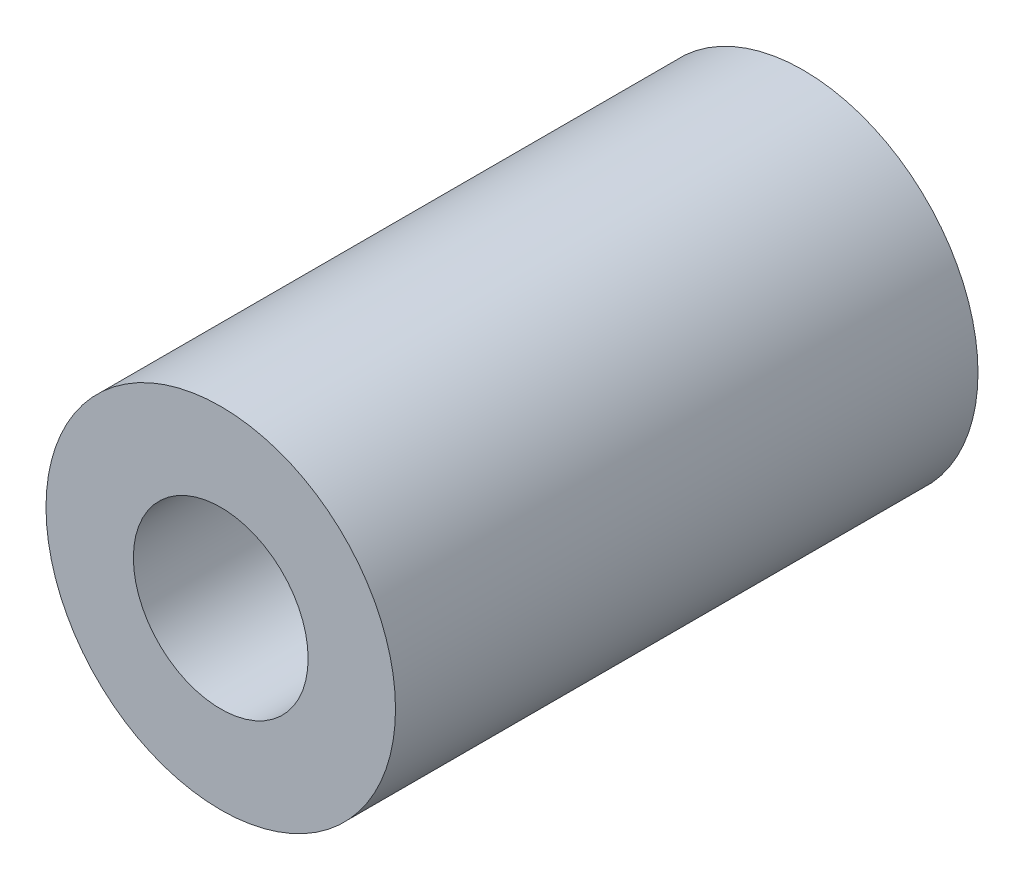
ISO-10303-21;
HEADER;
FILE_DESCRIPTION(('STEP AP214'),'2;1');
FILE_NAME('part.step','',(''),(''),'','','');
FILE_SCHEMA(('AUTOMOTIVE_DESIGN { 1 0 10303 214 1 1 1 1 }'));
ENDSEC;
DATA;
#1=APPLICATION_CONTEXT('core data for automotive mechanical design processes');
#2=APPLICATION_PROTOCOL_DEFINITION('international standard','automotive_design',2000,#1);
#3=PRODUCT_CONTEXT('',#1,'mechanical');
#4=PRODUCT('Part','Part','',(#3));
#5=PRODUCT_RELATED_PRODUCT_CATEGORY('part','',(#4));
#6=PRODUCT_DEFINITION_FORMATION('','',#4);
#7=PRODUCT_DEFINITION_CONTEXT('part definition',#1,'design');
#8=PRODUCT_DEFINITION('design','',#6,#7);
#9=PRODUCT_DEFINITION_SHAPE('','',#8);
#10=(LENGTH_UNIT() NAMED_UNIT(*) SI_UNIT(.MILLI.,.METRE.));
#11=(NAMED_UNIT(*) PLANE_ANGLE_UNIT() SI_UNIT($,.RADIAN.));
#12=(NAMED_UNIT(*) SI_UNIT($,.STERADIAN.) SOLID_ANGLE_UNIT());
#13=UNCERTAINTY_MEASURE_WITH_UNIT(LENGTH_MEASURE(1.E-05),#10,'distance_accuracy_value','');
#14=(GEOMETRIC_REPRESENTATION_CONTEXT(3) GLOBAL_UNCERTAINTY_ASSIGNED_CONTEXT((#13)) GLOBAL_UNIT_ASSIGNED_CONTEXT((#10,
#11,#12)) REPRESENTATION_CONTEXT('',''));
#15=CARTESIAN_POINT('',(0.,0.,0.));
#16=DIRECTION('',(0.,0.,1.));
#17=DIRECTION('',(1.,0.,0.));
#18=AXIS2_PLACEMENT_3D('',#15,#16,#17);
#19=CARTESIAN_POINT('',(0.,0.,10.));
#20=DIRECTION('',(0.,0.,1.));
#21=DIRECTION('',(1.,0.,0.));
#22=AXIS2_PLACEMENT_3D('',#19,#20,#21);
#23=PLANE('',#22);
#24=CARTESIAN_POINT('',(0.,0.,10.));
#25=DIRECTION('',(0.,0.,1.));
#26=DIRECTION('',(1.,0.,0.));
#27=AXIS2_PLACEMENT_3D('',#24,#25,#26);
#28=CIRCLE('',#27,3.);
#29=CARTESIAN_POINT('',(3.,0.,10.));
#30=VERTEX_POINT('',#29);
#31=EDGE_CURVE('E10',#30,#30,#28,.T.);
#32=ORIENTED_EDGE('',*,*,#31,.T.);
#33=EDGE_LOOP('',(#32));
#34=FACE_BOUND('',#33,.T.);
#35=CARTESIAN_POINT('',(0.,0.,10.));
#36=DIRECTION('',(0.,0.,1.));
#37=DIRECTION('',(1.,0.,0.));
#38=AXIS2_PLACEMENT_3D('',#35,#36,#37);
#39=CIRCLE('',#38,1.5);
#40=CARTESIAN_POINT('',(1.5,0.,10.));
#41=VERTEX_POINT('',#40);
#42=EDGE_CURVE('E42',#41,#41,#39,.T.);
#43=ORIENTED_EDGE('',*,*,#42,.F.);
#44=EDGE_LOOP('',(#43));
#45=FACE_BOUND('',#44,.T.);
#46=ADVANCED_FACE('F31',(#34,#45),#23,.T.);
#47=CARTESIAN_POINT('',(0.,0.,0.));
#48=DIRECTION('',(0.,0.,1.));
#49=DIRECTION('',(1.,0.,0.));
#50=AXIS2_PLACEMENT_3D('',#47,#48,#49);
#51=PLANE('',#50);
#52=CARTESIAN_POINT('',(0.,0.,0.));
#53=DIRECTION('',(0.,0.,1.));
#54=DIRECTION('',(1.,0.,0.));
#55=AXIS2_PLACEMENT_3D('',#52,#53,#54);
#56=CIRCLE('',#55,3.);
#57=CARTESIAN_POINT('',(3.,0.,0.));
#58=VERTEX_POINT('',#57);
#59=EDGE_CURVE('E35',#58,#58,#56,.T.);
#60=ORIENTED_EDGE('',*,*,#59,.F.);
#61=EDGE_LOOP('',(#60));
#62=FACE_BOUND('',#61,.T.);
#63=CARTESIAN_POINT('',(0.,0.,0.));
#64=DIRECTION('',(0.,0.,1.));
#65=DIRECTION('',(1.,0.,0.));
#66=AXIS2_PLACEMENT_3D('',#63,#64,#65);
#67=CIRCLE('',#66,1.5);
#68=CARTESIAN_POINT('',(1.5,0.,0.));
#69=VERTEX_POINT('',#68);
#70=EDGE_CURVE('E44',#69,#69,#67,.T.);
#71=ORIENTED_EDGE('',*,*,#70,.T.);
#72=EDGE_LOOP('',(#71));
#73=FACE_BOUND('',#72,.T.);
#74=ADVANCED_FACE('F54',(#62,#73),#51,.F.);
#75=CARTESIAN_POINT('',(0.,0.,10.));
#76=DIRECTION('',(0.,0.,-1.));
#77=DIRECTION('',(-1.,0.,0.));
#78=AXIS2_PLACEMENT_3D('',#75,#76,#77);
#79=CYLINDRICAL_SURFACE('',#78,3.);
#80=ORIENTED_EDGE('',*,*,#31,.F.);
#81=EDGE_LOOP('',(#80));
#82=FACE_BOUND('',#81,.T.);
#83=ORIENTED_EDGE('',*,*,#59,.T.);
#84=EDGE_LOOP('',(#83));
#85=FACE_BOUND('',#84,.T.);
#86=ADVANCED_FACE('F33',(#82,#85),#79,.T.);
#87=CARTESIAN_POINT('',(0.,0.,10.));
#88=DIRECTION('',(0.,0.,-1.));
#89=DIRECTION('',(-1.,0.,0.));
#90=AXIS2_PLACEMENT_3D('',#87,#88,#89);
#91=CYLINDRICAL_SURFACE('',#90,1.5);
#92=ORIENTED_EDGE('',*,*,#42,.T.);
#93=EDGE_LOOP('',(#92));
#94=FACE_BOUND('',#93,.T.);
#95=ORIENTED_EDGE('',*,*,#70,.F.);
#96=EDGE_LOOP('',(#95));
#97=FACE_BOUND('',#96,.T.);
#98=ADVANCED_FACE('F50',(#94,#97),#91,.F.);
#99=CLOSED_SHELL('',(#46,#74,#86,#98));
#100=MANIFOLD_SOLID_BREP('B2',#99);
#101=ADVANCED_BREP_SHAPE_REPRESENTATION('',(#18,#100),#14);
#102=SHAPE_DEFINITION_REPRESENTATION(#9,#101);
ENDSEC;
END-ISO-10303-21;
